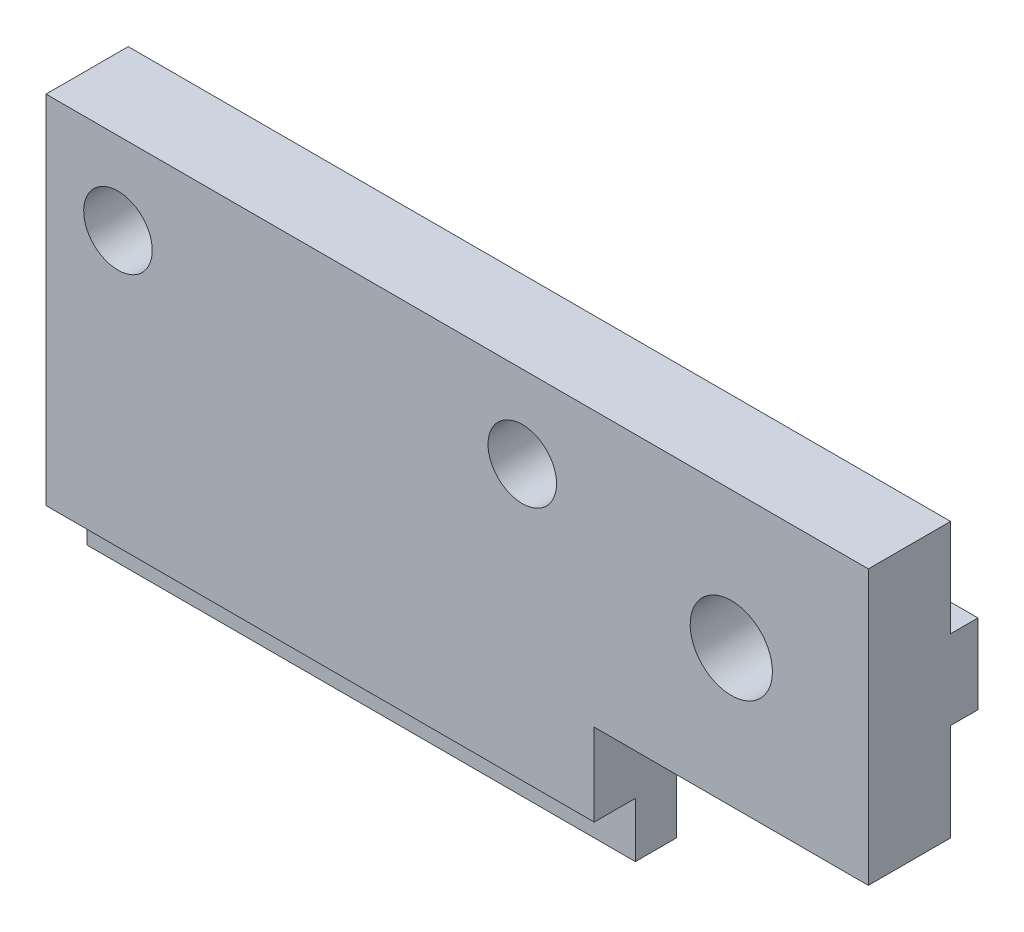
ISO-10303-21;
HEADER;
FILE_DESCRIPTION(('STEP AP214'),'2;1');
FILE_NAME('part.step','',(''),(''),'','','');
FILE_SCHEMA(('AUTOMOTIVE_DESIGN { 1 0 10303 214 1 1 1 1 }'));
ENDSEC;
DATA;
#1=APPLICATION_CONTEXT('core data for automotive mechanical design processes');
#2=APPLICATION_PROTOCOL_DEFINITION('international standard','automotive_design',2000,#1);
#3=PRODUCT_CONTEXT('',#1,'mechanical');
#4=PRODUCT('Part','Part','',(#3));
#5=PRODUCT_RELATED_PRODUCT_CATEGORY('part','',(#4));
#6=PRODUCT_DEFINITION_FORMATION('','',#4);
#7=PRODUCT_DEFINITION_CONTEXT('part definition',#1,'design');
#8=PRODUCT_DEFINITION('design','',#6,#7);
#9=PRODUCT_DEFINITION_SHAPE('','',#8);
#10=(LENGTH_UNIT() NAMED_UNIT(*) SI_UNIT(.MILLI.,.METRE.));
#11=(NAMED_UNIT(*) PLANE_ANGLE_UNIT() SI_UNIT($,.RADIAN.));
#12=(NAMED_UNIT(*) SI_UNIT($,.STERADIAN.) SOLID_ANGLE_UNIT());
#13=UNCERTAINTY_MEASURE_WITH_UNIT(LENGTH_MEASURE(1.E-05),#10,'distance_accuracy_value','');
#14=(GEOMETRIC_REPRESENTATION_CONTEXT(3) GLOBAL_UNCERTAINTY_ASSIGNED_CONTEXT((#13)) GLOBAL_UNIT_ASSIGNED_CONTEXT((#10,
#11,#12)) REPRESENTATION_CONTEXT('',''));
#15=CARTESIAN_POINT('',(0.,0.,0.));
#16=DIRECTION('',(0.,0.,1.));
#17=DIRECTION('',(1.,0.,0.));
#18=AXIS2_PLACEMENT_3D('',#15,#16,#17);
#19=CARTESIAN_POINT('',(23.0675723300356,1.05,0.));
#20=DIRECTION('',(0.,-1.,0.));
#21=DIRECTION('',(0.,0.,-1.));
#22=AXIS2_PLACEMENT_3D('',#19,#20,#21);
#23=PLANE('',#22);
#24=DIRECTION('',(0.,0.,1.));
#25=VECTOR('',#24,1.);
#26=CARTESIAN_POINT('',(15.3840572873934,1.05,-0.999999999999999));
#27=LINE('',#26,#25);
#28=CARTESIAN_POINT('',(15.3840572873934,1.05,-1.));
#29=VERTEX_POINT('',#28);
#30=CARTESIAN_POINT('',(15.3840572873934,1.05,0.));
#31=VERTEX_POINT('',#30);
#32=EDGE_CURVE('E259',#29,#31,#27,.T.);
#33=ORIENTED_EDGE('',*,*,#32,.F.);
#34=DIRECTION('',(-1.,0.,0.));
#35=VECTOR('',#34,1.);
#36=CARTESIAN_POINT('',(23.0675723300356,1.05,-1.));
#37=LINE('',#36,#35);
#38=CARTESIAN_POINT('',(20.,1.05,-1.));
#39=VERTEX_POINT('',#38);
#40=EDGE_CURVE('E185',#39,#29,#37,.T.);
#41=ORIENTED_EDGE('',*,*,#40,.F.);
#42=DIRECTION('',(0.,0.,-1.));
#43=VECTOR('',#42,1.);
#44=CARTESIAN_POINT('',(20.,1.05,0.));
#45=LINE('',#44,#43);
#46=CARTESIAN_POINT('',(20.,1.05,0.));
#47=VERTEX_POINT('',#46);
#48=EDGE_CURVE('E235',#47,#39,#45,.T.);
#49=ORIENTED_EDGE('',*,*,#48,.F.);
#50=DIRECTION('',(-1.,0.,0.));
#51=VECTOR('',#50,1.);
#52=CARTESIAN_POINT('',(23.0675723300356,1.05,0.));
#53=LINE('',#52,#51);
#54=EDGE_CURVE('E224',#47,#31,#53,.T.);
#55=ORIENTED_EDGE('',*,*,#54,.T.);
#56=EDGE_LOOP('',(#33,#41,#49,#55));
#57=FACE_BOUND('',#56,.T.);
#58=ADVANCED_FACE('F33',(#57),#23,.T.);
#59=CARTESIAN_POINT('',(23.0675723300356,3.95,-1.));
#60=DIRECTION('',(0.,0.,-1.));
#61=DIRECTION('',(0.,1.,0.));
#62=AXIS2_PLACEMENT_3D('',#59,#60,#61);
#63=PLANE('',#62);
#64=CARTESIAN_POINT('',(15.,2.5,-1.));
#65=DIRECTION('',(0.,0.,1.));
#66=DIRECTION('',(1.,0.,0.));
#67=AXIS2_PLACEMENT_3D('',#64,#65,#66);
#68=CIRCLE('',#67,1.5);
#69=CARTESIAN_POINT('',(15.3840572873934,3.95,-1.));
#70=VERTEX_POINT('',#69);
#71=EDGE_CURVE('E170',#29,#70,#68,.T.);
#72=ORIENTED_EDGE('',*,*,#71,.T.);
#73=DIRECTION('',(-1.,0.,0.));
#74=VECTOR('',#73,1.);
#75=CARTESIAN_POINT('',(23.0675723300356,3.95,-1.));
#76=LINE('',#75,#74);
#77=CARTESIAN_POINT('',(20.,3.95,-1.));
#78=VERTEX_POINT('',#77);
#79=EDGE_CURVE('E182',#78,#70,#76,.T.);
#80=ORIENTED_EDGE('',*,*,#79,.F.);
#81=DIRECTION('',(0.,1.,0.));
#82=VECTOR('',#81,1.);
#83=CARTESIAN_POINT('',(20.,3.95,-1.));
#84=LINE('',#83,#82);
#85=EDGE_CURVE('E232',#39,#78,#84,.T.);
#86=ORIENTED_EDGE('',*,*,#85,.F.);
#87=ORIENTED_EDGE('',*,*,#40,.T.);
#88=EDGE_LOOP('',(#72,#80,#86,#87));
#89=FACE_BOUND('',#88,.T.);
#90=ADVANCED_FACE('F180',(#89),#63,.T.);
#91=CARTESIAN_POINT('',(23.0675723300356,3.95,0.));
#92=DIRECTION('',(0.,1.,0.));
#93=DIRECTION('',(0.,0.,1.));
#94=AXIS2_PLACEMENT_3D('',#91,#92,#93);
#95=PLANE('',#94);
#96=DIRECTION('',(0.,0.,1.));
#97=VECTOR('',#96,1.);
#98=CARTESIAN_POINT('',(6.25250278396782,3.95,-1.));
#99=LINE('',#98,#97);
#100=CARTESIAN_POINT('',(6.25250278396782,3.95,-1.));
#101=VERTEX_POINT('',#100);
#102=CARTESIAN_POINT('',(6.25250278396782,3.95,0.));
#103=VERTEX_POINT('',#102);
#104=EDGE_CURVE('E11',#101,#103,#99,.T.);
#105=ORIENTED_EDGE('',*,*,#104,.F.);
#106=CARTESIAN_POINT('',(-6.25250278396782,3.95,-1.));
#107=VERTEX_POINT('',#106);
#108=EDGE_CURVE('E193',#101,#107,#76,.T.);
#109=ORIENTED_EDGE('',*,*,#108,.T.);
#110=DIRECTION('',(0.,0.,1.));
#111=VECTOR('',#110,1.);
#112=CARTESIAN_POINT('',(-6.25250278396782,3.95,-1.));
#113=LINE('',#112,#111);
#114=CARTESIAN_POINT('',(-6.25250278396782,3.95,0.));
#115=VERTEX_POINT('',#114);
#116=EDGE_CURVE('E213',#115,#107,#113,.F.);
#117=ORIENTED_EDGE('',*,*,#116,.F.);
#118=DIRECTION('',(-1.,0.,0.));
#119=VECTOR('',#118,1.);
#120=CARTESIAN_POINT('',(23.0675723300356,3.95,0.));
#121=LINE('',#120,#119);
#122=EDGE_CURVE('E214',#103,#115,#121,.T.);
#123=ORIENTED_EDGE('',*,*,#122,.F.);
#124=EDGE_LOOP('',(#105,#109,#117,#123));
#125=FACE_BOUND('',#124,.T.);
#126=ADVANCED_FACE('F405',(#125),#95,.T.);
#127=DIRECTION('',(0.,0.,1.));
#128=VECTOR('',#127,1.);
#129=CARTESIAN_POINT('',(8.49749721603218,3.95,-1.));
#130=LINE('',#129,#128);
#131=CARTESIAN_POINT('',(8.49749721603218,3.95,0.));
#132=VERTEX_POINT('',#131);
#133=CARTESIAN_POINT('',(8.49749721603218,3.95,-1.));
#134=VERTEX_POINT('',#133);
#135=EDGE_CURVE('E41',#132,#134,#130,.F.);
#136=ORIENTED_EDGE('',*,*,#135,.F.);
#137=CARTESIAN_POINT('',(14.6159427126066,3.95,0.));
#138=VERTEX_POINT('',#137);
#139=EDGE_CURVE('E205',#138,#132,#121,.T.);
#140=ORIENTED_EDGE('',*,*,#139,.F.);
#141=DIRECTION('',(0.,0.,1.));
#142=VECTOR('',#141,1.);
#143=CARTESIAN_POINT('',(14.6159427126066,3.95,-1.));
#144=LINE('',#143,#142);
#145=CARTESIAN_POINT('',(14.6159427126066,3.95,-1.));
#146=VERTEX_POINT('',#145);
#147=EDGE_CURVE('E174',#146,#138,#144,.T.);
#148=ORIENTED_EDGE('',*,*,#147,.F.);
#149=EDGE_CURVE('E191',#146,#134,#76,.T.);
#150=ORIENTED_EDGE('',*,*,#149,.T.);
#151=EDGE_LOOP('',(#136,#140,#148,#150));
#152=FACE_BOUND('',#151,.T.);
#153=ADVANCED_FACE('F280',(#152),#95,.T.);
#154=DIRECTION('',(0.,0.,1.));
#155=VECTOR('',#154,1.);
#156=CARTESIAN_POINT('',(-8.49749721603218,3.95,-1.));
#157=LINE('',#156,#155);
#158=CARTESIAN_POINT('',(-8.49749721603218,3.95,-1.));
#159=VERTEX_POINT('',#158);
#160=CARTESIAN_POINT('',(-8.49749721603218,3.95,0.));
#161=VERTEX_POINT('',#160);
#162=EDGE_CURVE('E175',#159,#161,#157,.T.);
#163=ORIENTED_EDGE('',*,*,#162,.F.);
#164=CARTESIAN_POINT('',(-10.,3.95,-1.));
#165=VERTEX_POINT('',#164);
#166=EDGE_CURVE('E194',#159,#165,#76,.T.);
#167=ORIENTED_EDGE('',*,*,#166,.T.);
#168=DIRECTION('',(0.,0.,-1.));
#169=VECTOR('',#168,1.);
#170=CARTESIAN_POINT('',(-10.,3.95,0.));
#171=LINE('',#170,#169);
#172=CARTESIAN_POINT('',(-10.,3.95,0.));
#173=VERTEX_POINT('',#172);
#174=EDGE_CURVE('E243',#173,#165,#171,.T.);
#175=ORIENTED_EDGE('',*,*,#174,.F.);
#176=EDGE_CURVE('E206',#161,#173,#121,.T.);
#177=ORIENTED_EDGE('',*,*,#176,.F.);
#178=EDGE_LOOP('',(#163,#167,#175,#177));
#179=FACE_BOUND('',#178,.T.);
#180=ADVANCED_FACE('F268',(#179),#95,.T.);
#181=CARTESIAN_POINT('',(0.,0.,0.));
#182=DIRECTION('',(0.,0.,-1.));
#183=DIRECTION('',(-1.,0.,0.));
#184=AXIS2_PLACEMENT_3D('',#181,#182,#183);
#185=PLANE('',#184);
#186=DIRECTION('',(0.,1.,0.));
#187=VECTOR('',#186,1.);
#188=CARTESIAN_POINT('',(20.,-2.5,0.));
#189=LINE('',#188,#187);
#190=CARTESIAN_POINT('',(20.,3.95,0.));
#191=VERTEX_POINT('',#190);
#192=CARTESIAN_POINT('',(20.,7.5,0.));
#193=VERTEX_POINT('',#192);
#194=EDGE_CURVE('E322',#191,#193,#189,.T.);
#195=ORIENTED_EDGE('',*,*,#194,.F.);
#196=CARTESIAN_POINT('',(15.3840572873934,3.95,0.));
#197=VERTEX_POINT('',#196);
#198=EDGE_CURVE('E198',#191,#197,#121,.T.);
#199=ORIENTED_EDGE('',*,*,#198,.T.);
#200=CARTESIAN_POINT('',(15.,2.5,0.));
#201=DIRECTION('',(0.,0.,1.));
#202=DIRECTION('',(1.,0.,0.));
#203=AXIS2_PLACEMENT_3D('',#200,#201,#202);
#204=CIRCLE('',#203,1.5);
#205=EDGE_CURVE('E173',#197,#138,#204,.T.);
#206=ORIENTED_EDGE('',*,*,#205,.T.);
#207=ORIENTED_EDGE('',*,*,#139,.T.);
#208=CARTESIAN_POINT('',(7.375,4.5,0.));
#209=DIRECTION('',(0.,0.,1.));
#210=DIRECTION('',(1.,0.,0.));
#211=AXIS2_PLACEMENT_3D('',#208,#209,#210);
#212=CIRCLE('',#211,1.25);
#213=EDGE_CURVE('E277',#132,#103,#212,.T.);
#214=ORIENTED_EDGE('',*,*,#213,.T.);
#215=ORIENTED_EDGE('',*,*,#122,.T.);
#216=CARTESIAN_POINT('',(-7.375,4.5,0.));
#217=DIRECTION('',(0.,0.,1.));
#218=DIRECTION('',(1.,0.,0.));
#219=AXIS2_PLACEMENT_3D('',#216,#217,#218);
#220=CIRCLE('',#219,1.25);
#221=EDGE_CURVE('E293',#115,#161,#220,.T.);
#222=ORIENTED_EDGE('',*,*,#221,.T.);
#223=ORIENTED_EDGE('',*,*,#176,.T.);
#224=DIRECTION('',(0.,-1.,0.));
#225=VECTOR('',#224,1.);
#226=CARTESIAN_POINT('',(-10.,-7.5,0.));
#227=LINE('',#226,#225);
#228=CARTESIAN_POINT('',(-10.,7.5,0.));
#229=VERTEX_POINT('',#228);
#230=EDGE_CURVE('E313',#229,#173,#227,.T.);
#231=ORIENTED_EDGE('',*,*,#230,.F.);
#232=DIRECTION('',(-1.,0.,0.));
#233=VECTOR('',#232,1.);
#234=CARTESIAN_POINT('',(-10.,7.5,0.));
#235=LINE('',#234,#233);
#236=EDGE_CURVE('E304',#193,#229,#235,.T.);
#237=ORIENTED_EDGE('',*,*,#236,.F.);
#238=EDGE_LOOP('',(#195,#199,#206,#207,#214,#215,#222,#223,#231,#237));
#239=FACE_BOUND('',#238,.T.);
#240=ADVANCED_FACE('F281',(#239),#185,.T.);
#241=CARTESIAN_POINT('',(0.,0.,3.));
#242=DIRECTION('',(0.,0.,-1.));
#243=DIRECTION('',(-1.,0.,0.));
#244=AXIS2_PLACEMENT_3D('',#241,#242,#243);
#245=PLANE('',#244);
#246=DIRECTION('',(0.,-1.,0.));
#247=VECTOR('',#246,1.);
#248=CARTESIAN_POINT('',(-10.,-7.5,3.));
#249=LINE('',#248,#247);
#250=CARTESIAN_POINT('',(-10.,7.5,3.));
#251=VERTEX_POINT('',#250);
#252=CARTESIAN_POINT('',(-10.,-5.5,3.));
#253=VERTEX_POINT('',#252);
#254=EDGE_CURVE('E300',#251,#253,#249,.T.);
#255=ORIENTED_EDGE('',*,*,#254,.T.);
#256=DIRECTION('',(-1.,0.,0.));
#257=VECTOR('',#256,1.);
#258=CARTESIAN_POINT('',(-10.,-5.5,3.));
#259=LINE('',#258,#257);
#260=CARTESIAN_POINT('',(10.,-5.5,3.));
#261=VERTEX_POINT('',#260);
#262=EDGE_CURVE('E369',#261,#253,#259,.T.);
#263=ORIENTED_EDGE('',*,*,#262,.F.);
#264=DIRECTION('',(0.,1.,0.));
#265=VECTOR('',#264,1.);
#266=CARTESIAN_POINT('',(10.,-7.5,3.));
#267=LINE('',#266,#265);
#268=CARTESIAN_POINT('',(10.,-2.5,3.));
#269=VERTEX_POINT('',#268);
#270=EDGE_CURVE('E303',#261,#269,#267,.T.);
#271=ORIENTED_EDGE('',*,*,#270,.T.);
#272=DIRECTION('',(1.,0.,0.));
#273=VECTOR('',#272,1.);
#274=CARTESIAN_POINT('',(10.,-2.5,3.));
#275=LINE('',#274,#273);
#276=CARTESIAN_POINT('',(20.,-2.5,3.));
#277=VERTEX_POINT('',#276);
#278=EDGE_CURVE('E306',#269,#277,#275,.T.);
#279=ORIENTED_EDGE('',*,*,#278,.T.);
#280=DIRECTION('',(0.,1.,0.));
#281=VECTOR('',#280,1.);
#282=CARTESIAN_POINT('',(20.,-2.5,3.));
#283=LINE('',#282,#281);
#284=CARTESIAN_POINT('',(20.,7.5,3.));
#285=VERTEX_POINT('',#284);
#286=EDGE_CURVE('E308',#277,#285,#283,.T.);
#287=ORIENTED_EDGE('',*,*,#286,.T.);
#288=DIRECTION('',(-1.,0.,0.));
#289=VECTOR('',#288,1.);
#290=CARTESIAN_POINT('',(-10.,7.5,3.));
#291=LINE('',#290,#289);
#292=EDGE_CURVE('E310',#285,#251,#291,.T.);
#293=ORIENTED_EDGE('',*,*,#292,.T.);
#294=EDGE_LOOP('',(#255,#263,#271,#279,#287,#293));
#295=FACE_BOUND('',#294,.T.);
#296=CARTESIAN_POINT('',(-7.375,4.5,3.));
#297=DIRECTION('',(0.,0.,1.));
#298=DIRECTION('',(1.,0.,0.));
#299=AXIS2_PLACEMENT_3D('',#296,#297,#298);
#300=CIRCLE('',#299,1.25);
#301=CARTESIAN_POINT('',(-6.125,4.5,3.));
#302=VERTEX_POINT('',#301);
#303=EDGE_CURVE('E295',#302,#302,#300,.T.);
#304=ORIENTED_EDGE('',*,*,#303,.F.);
#305=EDGE_LOOP('',(#304));
#306=FACE_BOUND('',#305,.T.);
#307=CARTESIAN_POINT('',(7.375,4.5,3.));
#308=DIRECTION('',(0.,0.,1.));
#309=DIRECTION('',(1.,0.,0.));
#310=AXIS2_PLACEMENT_3D('',#307,#308,#309);
#311=CIRCLE('',#310,1.25);
#312=CARTESIAN_POINT('',(8.625,4.5,3.));
#313=VERTEX_POINT('',#312);
#314=EDGE_CURVE('E290',#313,#313,#311,.T.);
#315=ORIENTED_EDGE('',*,*,#314,.F.);
#316=EDGE_LOOP('',(#315));
#317=FACE_BOUND('',#316,.T.);
#318=CARTESIAN_POINT('',(15.,2.5,3.));
#319=DIRECTION('',(0.,0.,1.));
#320=DIRECTION('',(1.,0.,0.));
#321=AXIS2_PLACEMENT_3D('',#318,#319,#320);
#322=CIRCLE('',#321,1.5);
#323=CARTESIAN_POINT('',(16.5,2.5,3.));
#324=VERTEX_POINT('',#323);
#325=EDGE_CURVE('E282',#324,#324,#322,.T.);
#326=ORIENTED_EDGE('',*,*,#325,.F.);
#327=EDGE_LOOP('',(#326));
#328=FACE_BOUND('',#327,.T.);
#329=ADVANCED_FACE('F365',(#295,#306,#317,#328),#245,.F.);
#330=ORIENTED_EDGE('',*,*,#54,.F.);
#331=CARTESIAN_POINT('',(20.,-2.5,0.));
#332=VERTEX_POINT('',#331);
#333=EDGE_CURVE('E323',#332,#47,#189,.T.);
#334=ORIENTED_EDGE('',*,*,#333,.F.);
#335=DIRECTION('',(1.,0.,0.));
#336=VECTOR('',#335,1.);
#337=CARTESIAN_POINT('',(10.,-2.5,0.));
#338=LINE('',#337,#336);
#339=CARTESIAN_POINT('',(10.,-2.5,0.));
#340=VERTEX_POINT('',#339);
#341=EDGE_CURVE('E320',#340,#332,#338,.T.);
#342=ORIENTED_EDGE('',*,*,#341,.F.);
#343=DIRECTION('',(0.,1.,0.));
#344=VECTOR('',#343,1.);
#345=CARTESIAN_POINT('',(10.,-7.5,0.));
#346=LINE('',#345,#344);
#347=CARTESIAN_POINT('',(10.,-7.5,0.));
#348=VERTEX_POINT('',#347);
#349=EDGE_CURVE('E318',#348,#340,#346,.T.);
#350=ORIENTED_EDGE('',*,*,#349,.F.);
#351=DIRECTION('',(1.,0.,0.));
#352=VECTOR('',#351,1.);
#353=CARTESIAN_POINT('',(-10.,-7.5,0.));
#354=LINE('',#353,#352);
#355=CARTESIAN_POINT('',(-10.,-7.5,0.));
#356=VERTEX_POINT('',#355);
#357=EDGE_CURVE('E315',#356,#348,#354,.T.);
#358=ORIENTED_EDGE('',*,*,#357,.F.);
#359=CARTESIAN_POINT('',(-10.,1.05,0.));
#360=VERTEX_POINT('',#359);
#361=EDGE_CURVE('E298',#360,#356,#227,.T.);
#362=ORIENTED_EDGE('',*,*,#361,.F.);
#363=CARTESIAN_POINT('',(14.6159427126066,1.05,0.));
#364=VERTEX_POINT('',#363);
#365=EDGE_CURVE('E215',#364,#360,#53,.T.);
#366=ORIENTED_EDGE('',*,*,#365,.F.);
#367=EDGE_CURVE('E283',#364,#31,#204,.T.);
#368=ORIENTED_EDGE('',*,*,#367,.T.);
#369=EDGE_LOOP('',(#330,#334,#342,#350,#358,#362,#366,#368));
#370=FACE_BOUND('',#369,.T.);
#371=ADVANCED_FACE('F354',(#370),#185,.T.);
#372=CARTESIAN_POINT('',(-10.,-7.5,3.));
#373=DIRECTION('',(1.,0.,0.));
#374=DIRECTION('',(0.,0.,-1.));
#375=AXIS2_PLACEMENT_3D('',#372,#373,#374);
#376=PLANE('',#375);
#377=DIRECTION('',(0.,-1.,0.));
#378=VECTOR('',#377,1.);
#379=CARTESIAN_POINT('',(-10.,-7.5,1.5));
#380=LINE('',#379,#378);
#381=CARTESIAN_POINT('',(-10.,-5.5,1.5));
#382=VERTEX_POINT('',#381);
#383=CARTESIAN_POINT('',(-10.,-7.5,1.5));
#384=VERTEX_POINT('',#383);
#385=EDGE_CURVE('E379',#382,#384,#380,.T.);
#386=ORIENTED_EDGE('',*,*,#385,.F.);
#387=DIRECTION('',(0.,0.,1.));
#388=VECTOR('',#387,1.);
#389=CARTESIAN_POINT('',(-10.,-5.5,1.5));
#390=LINE('',#389,#388);
#391=EDGE_CURVE('E287',#382,#253,#390,.T.);
#392=ORIENTED_EDGE('',*,*,#391,.T.);
#393=ORIENTED_EDGE('',*,*,#254,.F.);
#394=DIRECTION('',(0.,0.,-1.));
#395=VECTOR('',#394,1.);
#396=CARTESIAN_POINT('',(-10.,7.5,3.));
#397=LINE('',#396,#395);
#398=EDGE_CURVE('E312',#251,#229,#397,.T.);
#399=ORIENTED_EDGE('',*,*,#398,.T.);
#400=ORIENTED_EDGE('',*,*,#230,.T.);
#401=ORIENTED_EDGE('',*,*,#174,.T.);
#402=DIRECTION('',(0.,-1.,0.));
#403=VECTOR('',#402,1.);
#404=CARTESIAN_POINT('',(-10.,3.95,-1.));
#405=LINE('',#404,#403);
#406=CARTESIAN_POINT('',(-10.,1.05,-1.));
#407=VERTEX_POINT('',#406);
#408=EDGE_CURVE('E209',#165,#407,#405,.T.);
#409=ORIENTED_EDGE('',*,*,#408,.T.);
#410=DIRECTION('',(0.,0.,1.));
#411=VECTOR('',#410,1.);
#412=CARTESIAN_POINT('',(-10.,1.05,0.));
#413=LINE('',#412,#411);
#414=EDGE_CURVE('E204',#407,#360,#413,.T.);
#415=ORIENTED_EDGE('',*,*,#414,.T.);
#416=ORIENTED_EDGE('',*,*,#361,.T.);
#417=DIRECTION('',(0.,0.,-1.));
#418=VECTOR('',#417,1.);
#419=CARTESIAN_POINT('',(-10.,-7.5,3.));
#420=LINE('',#419,#418);
#421=EDGE_CURVE('E222',#384,#356,#420,.T.);
#422=ORIENTED_EDGE('',*,*,#421,.F.);
#423=EDGE_LOOP('',(#386,#392,#393,#399,#400,#401,#409,#415,#416,#422));
#424=FACE_BOUND('',#423,.T.);
#425=ADVANCED_FACE('F35',(#424),#376,.F.);
#426=CARTESIAN_POINT('',(-10.,-7.5,3.));
#427=DIRECTION('',(0.,1.,0.));
#428=DIRECTION('',(0.,0.,1.));
#429=AXIS2_PLACEMENT_3D('',#426,#427,#428);
#430=PLANE('',#429);
#431=DIRECTION('',(0.,0.,-1.));
#432=VECTOR('',#431,1.);
#433=CARTESIAN_POINT('',(10.,-7.5,3.));
#434=LINE('',#433,#432);
#435=CARTESIAN_POINT('',(10.,-7.5,1.5));
#436=VERTEX_POINT('',#435);
#437=EDGE_CURVE('E229',#436,#348,#434,.T.);
#438=ORIENTED_EDGE('',*,*,#437,.F.);
#439=DIRECTION('',(1.,0.,0.));
#440=VECTOR('',#439,1.);
#441=CARTESIAN_POINT('',(-10.,-7.5,1.5));
#442=LINE('',#441,#440);
#443=EDGE_CURVE('E382',#384,#436,#442,.T.);
#444=ORIENTED_EDGE('',*,*,#443,.F.);
#445=ORIENTED_EDGE('',*,*,#421,.T.);
#446=ORIENTED_EDGE('',*,*,#357,.T.);
#447=EDGE_LOOP('',(#438,#444,#445,#446));
#448=FACE_BOUND('',#447,.T.);
#449=ADVANCED_FACE('F350',(#448),#430,.F.);
#450=CARTESIAN_POINT('',(10.,-7.5,3.));
#451=DIRECTION('',(-1.,0.,0.));
#452=DIRECTION('',(0.,0.,1.));
#453=AXIS2_PLACEMENT_3D('',#450,#451,#452);
#454=PLANE('',#453);
#455=ORIENTED_EDGE('',*,*,#270,.F.);
#456=DIRECTION('',(0.,0.,1.));
#457=VECTOR('',#456,1.);
#458=CARTESIAN_POINT('',(10.,-5.5,1.5));
#459=LINE('',#458,#457);
#460=CARTESIAN_POINT('',(10.,-5.5,1.5));
#461=VERTEX_POINT('',#460);
#462=EDGE_CURVE('E370',#461,#261,#459,.T.);
#463=ORIENTED_EDGE('',*,*,#462,.F.);
#464=DIRECTION('',(0.,1.,0.));
#465=VECTOR('',#464,1.);
#466=CARTESIAN_POINT('',(10.,-7.5,1.5));
#467=LINE('',#466,#465);
#468=EDGE_CURVE('E346',#436,#461,#467,.T.);
#469=ORIENTED_EDGE('',*,*,#468,.F.);
#470=ORIENTED_EDGE('',*,*,#437,.T.);
#471=ORIENTED_EDGE('',*,*,#349,.T.);
#472=DIRECTION('',(0.,0.,-1.));
#473=VECTOR('',#472,1.);
#474=CARTESIAN_POINT('',(10.,-2.5,3.));
#475=LINE('',#474,#473);
#476=EDGE_CURVE('E335',#269,#340,#475,.T.);
#477=ORIENTED_EDGE('',*,*,#476,.F.);
#478=EDGE_LOOP('',(#455,#463,#469,#470,#471,#477));
#479=FACE_BOUND('',#478,.T.);
#480=ADVANCED_FACE('F342',(#479),#454,.F.);
#481=CARTESIAN_POINT('',(10.,-2.5,3.));
#482=DIRECTION('',(0.,1.,0.));
#483=DIRECTION('',(0.,0.,1.));
#484=AXIS2_PLACEMENT_3D('',#481,#482,#483);
#485=PLANE('',#484);
#486=ORIENTED_EDGE('',*,*,#341,.T.);
#487=DIRECTION('',(0.,0.,-1.));
#488=VECTOR('',#487,1.);
#489=CARTESIAN_POINT('',(20.,-2.5,3.));
#490=LINE('',#489,#488);
#491=EDGE_CURVE('E332',#277,#332,#490,.T.);
#492=ORIENTED_EDGE('',*,*,#491,.F.);
#493=ORIENTED_EDGE('',*,*,#278,.F.);
#494=ORIENTED_EDGE('',*,*,#476,.T.);
#495=EDGE_LOOP('',(#486,#492,#493,#494));
#496=FACE_BOUND('',#495,.T.);
#497=ADVANCED_FACE('F358',(#496),#485,.F.);
#498=CARTESIAN_POINT('',(20.,-2.5,3.));
#499=DIRECTION('',(-1.,0.,0.));
#500=DIRECTION('',(0.,0.,1.));
#501=AXIS2_PLACEMENT_3D('',#498,#499,#500);
#502=PLANE('',#501);
#503=ORIENTED_EDGE('',*,*,#333,.T.);
#504=ORIENTED_EDGE('',*,*,#48,.T.);
#505=ORIENTED_EDGE('',*,*,#85,.T.);
#506=DIRECTION('',(0.,0.,1.));
#507=VECTOR('',#506,1.);
#508=CARTESIAN_POINT('',(20.,3.95,0.));
#509=LINE('',#508,#507);
#510=EDGE_CURVE('E189',#78,#191,#509,.T.);
#511=ORIENTED_EDGE('',*,*,#510,.T.);
#512=ORIENTED_EDGE('',*,*,#194,.T.);
#513=DIRECTION('',(0.,0.,-1.));
#514=VECTOR('',#513,1.);
#515=CARTESIAN_POINT('',(20.,7.5,3.));
#516=LINE('',#515,#514);
#517=EDGE_CURVE('E329',#285,#193,#516,.T.);
#518=ORIENTED_EDGE('',*,*,#517,.F.);
#519=ORIENTED_EDGE('',*,*,#286,.F.);
#520=ORIENTED_EDGE('',*,*,#491,.T.);
#521=EDGE_LOOP('',(#503,#504,#505,#511,#512,#518,#519,#520));
#522=FACE_BOUND('',#521,.T.);
#523=ADVANCED_FACE('F361',(#522),#502,.F.);
#524=CARTESIAN_POINT('',(-10.,7.5,3.));
#525=DIRECTION('',(0.,-1.,0.));
#526=DIRECTION('',(0.,0.,-1.));
#527=AXIS2_PLACEMENT_3D('',#524,#525,#526);
#528=PLANE('',#527);
#529=ORIENTED_EDGE('',*,*,#236,.T.);
#530=ORIENTED_EDGE('',*,*,#398,.F.);
#531=ORIENTED_EDGE('',*,*,#292,.F.);
#532=ORIENTED_EDGE('',*,*,#517,.T.);
#533=EDGE_LOOP('',(#529,#530,#531,#532));
#534=FACE_BOUND('',#533,.T.);
#535=ADVANCED_FACE('F386',(#534),#528,.F.);
#536=CARTESIAN_POINT('',(-7.375,4.5,3.));
#537=DIRECTION('',(0.,0.,-1.));
#538=DIRECTION('',(-1.,0.,0.));
#539=AXIS2_PLACEMENT_3D('',#536,#537,#538);
#540=CYLINDRICAL_SURFACE('',#539,1.25);
#541=ORIENTED_EDGE('',*,*,#303,.T.);
#542=EDGE_LOOP('',(#541));
#543=FACE_BOUND('',#542,.T.);
#544=ORIENTED_EDGE('',*,*,#221,.F.);
#545=ORIENTED_EDGE('',*,*,#116,.T.);
#546=CARTESIAN_POINT('',(-7.375,4.5,-1.));
#547=DIRECTION('',(0.,0.,1.));
#548=DIRECTION('',(1.,0.,0.));
#549=AXIS2_PLACEMENT_3D('',#546,#547,#548);
#550=CIRCLE('',#549,1.25);
#551=EDGE_CURVE('E240',#159,#107,#550,.T.);
#552=ORIENTED_EDGE('',*,*,#551,.F.);
#553=ORIENTED_EDGE('',*,*,#162,.T.);
#554=EDGE_LOOP('',(#544,#545,#552,#553));
#555=FACE_BOUND('',#554,.T.);
#556=ADVANCED_FACE('F267',(#543,#555),#540,.F.);
#557=CARTESIAN_POINT('',(7.375,4.5,3.));
#558=DIRECTION('',(0.,0.,-1.));
#559=DIRECTION('',(-1.,0.,0.));
#560=AXIS2_PLACEMENT_3D('',#557,#558,#559);
#561=CYLINDRICAL_SURFACE('',#560,1.25);
#562=ORIENTED_EDGE('',*,*,#314,.T.);
#563=EDGE_LOOP('',(#562));
#564=FACE_BOUND('',#563,.T.);
#565=ORIENTED_EDGE('',*,*,#213,.F.);
#566=ORIENTED_EDGE('',*,*,#135,.T.);
#567=CARTESIAN_POINT('',(7.375,4.5,-1.));
#568=DIRECTION('',(0.,0.,1.));
#569=DIRECTION('',(1.,0.,0.));
#570=AXIS2_PLACEMENT_3D('',#567,#568,#569);
#571=CIRCLE('',#570,1.25);
#572=EDGE_CURVE('E256',#101,#134,#571,.T.);
#573=ORIENTED_EDGE('',*,*,#572,.F.);
#574=ORIENTED_EDGE('',*,*,#104,.T.);
#575=EDGE_LOOP('',(#565,#566,#573,#574));
#576=FACE_BOUND('',#575,.T.);
#577=ADVANCED_FACE('F274',(#564,#576),#561,.F.);
#578=CARTESIAN_POINT('',(15.,2.5,3.));
#579=DIRECTION('',(0.,0.,-1.));
#580=DIRECTION('',(-1.,0.,0.));
#581=AXIS2_PLACEMENT_3D('',#578,#579,#580);
#582=CYLINDRICAL_SURFACE('',#581,1.5);
#583=ORIENTED_EDGE('',*,*,#325,.T.);
#584=EDGE_LOOP('',(#583));
#585=FACE_BOUND('',#584,.T.);
#586=ORIENTED_EDGE('',*,*,#205,.F.);
#587=DIRECTION('',(0.,0.,1.));
#588=VECTOR('',#587,1.);
#589=CARTESIAN_POINT('',(15.3840572873934,3.95,-1.));
#590=LINE('',#589,#588);
#591=EDGE_CURVE('E56',#197,#70,#590,.F.);
#592=ORIENTED_EDGE('',*,*,#591,.T.);
#593=ORIENTED_EDGE('',*,*,#71,.F.);
#594=ORIENTED_EDGE('',*,*,#32,.T.);
#595=ORIENTED_EDGE('',*,*,#367,.F.);
#596=DIRECTION('',(0.,0.,1.));
#597=VECTOR('',#596,1.);
#598=CARTESIAN_POINT('',(14.6159427126066,1.05,-0.999999999999999));
#599=LINE('',#598,#597);
#600=CARTESIAN_POINT('',(14.6159427126066,1.05,-1.));
#601=VERTEX_POINT('',#600);
#602=EDGE_CURVE('E252',#364,#601,#599,.F.);
#603=ORIENTED_EDGE('',*,*,#602,.T.);
#604=EDGE_CURVE('E48',#146,#601,#68,.T.);
#605=ORIENTED_EDGE('',*,*,#604,.F.);
#606=ORIENTED_EDGE('',*,*,#147,.T.);
#607=EDGE_LOOP('',(#586,#592,#593,#594,#595,#603,#605,#606));
#608=FACE_BOUND('',#607,.T.);
#609=ADVANCED_FACE('F169',(#585,#608),#582,.F.);
#610=CARTESIAN_POINT('',(-10.,-5.5,1.5));
#611=DIRECTION('',(0.,1.,0.));
#612=DIRECTION('',(0.,0.,1.));
#613=AXIS2_PLACEMENT_3D('',#610,#611,#612);
#614=PLANE('',#613);
#615=ORIENTED_EDGE('',*,*,#262,.T.);
#616=ORIENTED_EDGE('',*,*,#391,.F.);
#617=DIRECTION('',(-1.,0.,0.));
#618=VECTOR('',#617,1.);
#619=CARTESIAN_POINT('',(-10.,-5.5,1.5));
#620=LINE('',#619,#618);
#621=EDGE_CURVE('E373',#461,#382,#620,.T.);
#622=ORIENTED_EDGE('',*,*,#621,.F.);
#623=ORIENTED_EDGE('',*,*,#462,.T.);
#624=EDGE_LOOP('',(#615,#616,#622,#623));
#625=FACE_BOUND('',#624,.T.);
#626=ADVANCED_FACE('F388',(#625),#614,.F.);
#627=CARTESIAN_POINT('',(0.,0.,1.5));
#628=DIRECTION('',(0.,0.,-1.));
#629=DIRECTION('',(-1.,0.,0.));
#630=AXIS2_PLACEMENT_3D('',#627,#628,#629);
#631=PLANE('',#630);
#632=ORIENTED_EDGE('',*,*,#385,.T.);
#633=ORIENTED_EDGE('',*,*,#443,.T.);
#634=ORIENTED_EDGE('',*,*,#468,.T.);
#635=ORIENTED_EDGE('',*,*,#621,.T.);
#636=EDGE_LOOP('',(#632,#633,#634,#635));
#637=FACE_BOUND('',#636,.T.);
#638=ADVANCED_FACE('F390',(#637),#631,.F.);
#639=ORIENTED_EDGE('',*,*,#602,.F.);
#640=ORIENTED_EDGE('',*,*,#365,.T.);
#641=ORIENTED_EDGE('',*,*,#414,.F.);
#642=EDGE_CURVE('E190',#601,#407,#37,.T.);
#643=ORIENTED_EDGE('',*,*,#642,.F.);
#644=EDGE_LOOP('',(#639,#640,#641,#643));
#645=FACE_BOUND('',#644,.T.);
#646=ADVANCED_FACE('F251',(#645),#23,.T.);
#647=ORIENTED_EDGE('',*,*,#572,.T.);
#648=ORIENTED_EDGE('',*,*,#149,.F.);
#649=ORIENTED_EDGE('',*,*,#604,.T.);
#650=ORIENTED_EDGE('',*,*,#642,.T.);
#651=ORIENTED_EDGE('',*,*,#408,.F.);
#652=ORIENTED_EDGE('',*,*,#166,.F.);
#653=ORIENTED_EDGE('',*,*,#551,.T.);
#654=ORIENTED_EDGE('',*,*,#108,.F.);
#655=EDGE_LOOP('',(#647,#648,#649,#650,#651,#652,#653,#654));
#656=FACE_BOUND('',#655,.T.);
#657=ADVANCED_FACE('F254',(#656),#63,.T.);
#658=ORIENTED_EDGE('',*,*,#591,.F.);
#659=ORIENTED_EDGE('',*,*,#198,.F.);
#660=ORIENTED_EDGE('',*,*,#510,.F.);
#661=ORIENTED_EDGE('',*,*,#79,.T.);
#662=EDGE_LOOP('',(#658,#659,#660,#661));
#663=FACE_BOUND('',#662,.T.);
#664=ADVANCED_FACE('F187',(#663),#95,.T.);
#665=CLOSED_SHELL('',(#58,#90,#126,#153,#180,#240,#329,#371,#425,#449,#480,#497,#523,#535,#556,
#577,#609,#626,#638,#646,#657,#664));
#666=MANIFOLD_SOLID_BREP('B2',#665);
#667=ADVANCED_BREP_SHAPE_REPRESENTATION('',(#18,#666),#14);
#668=SHAPE_DEFINITION_REPRESENTATION(#9,#667);
ENDSEC;
END-ISO-10303-21;
